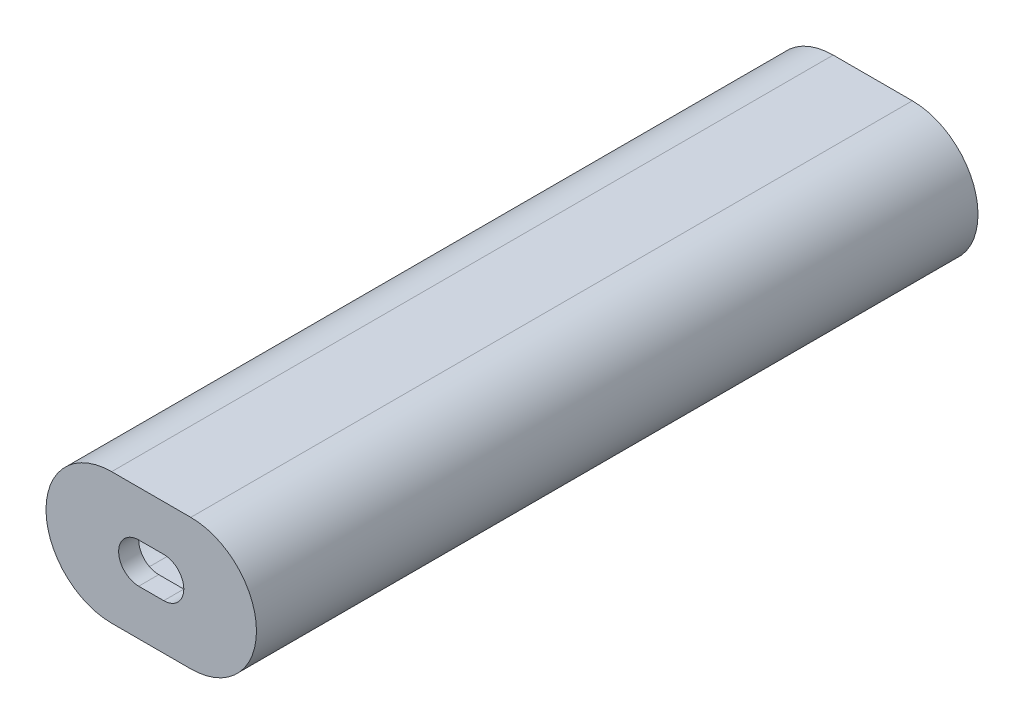
ISO-10303-21;
HEADER;
FILE_DESCRIPTION(('STEP AP214'),'2;1');
FILE_NAME('part.step','',(''),(''),'','','');
FILE_SCHEMA(('AUTOMOTIVE_DESIGN { 1 0 10303 214 1 1 1 1 }'));
ENDSEC;
DATA;
#1=APPLICATION_CONTEXT('core data for automotive mechanical design processes');
#2=APPLICATION_PROTOCOL_DEFINITION('international standard','automotive_design',2000,#1);
#3=PRODUCT_CONTEXT('',#1,'mechanical');
#4=PRODUCT('Part','Part','',(#3));
#5=PRODUCT_RELATED_PRODUCT_CATEGORY('part','',(#4));
#6=PRODUCT_DEFINITION_FORMATION('','',#4);
#7=PRODUCT_DEFINITION_CONTEXT('part definition',#1,'design');
#8=PRODUCT_DEFINITION('design','',#6,#7);
#9=PRODUCT_DEFINITION_SHAPE('','',#8);
#10=(LENGTH_UNIT() NAMED_UNIT(*) SI_UNIT(.MILLI.,.METRE.));
#11=(NAMED_UNIT(*) PLANE_ANGLE_UNIT() SI_UNIT($,.RADIAN.));
#12=(NAMED_UNIT(*) SI_UNIT($,.STERADIAN.) SOLID_ANGLE_UNIT());
#13=UNCERTAINTY_MEASURE_WITH_UNIT(LENGTH_MEASURE(1.E-05),#10,'distance_accuracy_value','');
#14=(GEOMETRIC_REPRESENTATION_CONTEXT(3) GLOBAL_UNCERTAINTY_ASSIGNED_CONTEXT((#13)) GLOBAL_UNIT_ASSIGNED_CONTEXT((#10,
#11,#12)) REPRESENTATION_CONTEXT('',''));
#15=CARTESIAN_POINT('',(0.,0.,0.));
#16=DIRECTION('',(0.,0.,1.));
#17=DIRECTION('',(1.,0.,0.));
#18=AXIS2_PLACEMENT_3D('',#15,#16,#17);
#19=CARTESIAN_POINT('',(12.573,0.,-177.8));
#20=DIRECTION('',(0.,0.,1.));
#21=DIRECTION('',(1.,0.,0.));
#22=AXIS2_PLACEMENT_3D('',#19,#20,#21);
#23=CYLINDRICAL_SURFACE('',#22,11.557);
#24=CARTESIAN_POINT('',(12.573,0.,0.));
#25=DIRECTION('',(0.,0.,1.));
#26=DIRECTION('',(1.,0.,0.));
#27=AXIS2_PLACEMENT_3D('',#24,#25,#26);
#28=CIRCLE('',#27,11.557);
#29=CARTESIAN_POINT('',(12.573,-11.557,0.));
#30=VERTEX_POINT('',#29);
#31=CARTESIAN_POINT('',(12.573,11.557,0.));
#32=VERTEX_POINT('',#31);
#33=EDGE_CURVE('E195',#30,#32,#28,.T.);
#34=ORIENTED_EDGE('',*,*,#33,.T.);
#35=DIRECTION('',(0.,0.,1.));
#36=VECTOR('',#35,1.);
#37=CARTESIAN_POINT('',(12.573,11.557,-177.8));
#38=LINE('',#37,#36);
#39=CARTESIAN_POINT('',(12.573,11.557,-177.8));
#40=VERTEX_POINT('',#39);
#41=EDGE_CURVE('E11',#40,#32,#38,.T.);
#42=ORIENTED_EDGE('',*,*,#41,.F.);
#43=CARTESIAN_POINT('',(12.573,0.,-177.8));
#44=DIRECTION('',(0.,0.,1.));
#45=DIRECTION('',(1.,0.,0.));
#46=AXIS2_PLACEMENT_3D('',#43,#44,#45);
#47=CIRCLE('',#46,11.557);
#48=CARTESIAN_POINT('',(12.573,-11.557,-177.8));
#49=VERTEX_POINT('',#48);
#50=EDGE_CURVE('E208',#49,#40,#47,.T.);
#51=ORIENTED_EDGE('',*,*,#50,.F.);
#52=DIRECTION('',(0.,0.,1.));
#53=VECTOR('',#52,1.);
#54=CARTESIAN_POINT('',(12.573,-11.557,-177.8));
#55=LINE('',#54,#53);
#56=EDGE_CURVE('E232',#49,#30,#55,.T.);
#57=ORIENTED_EDGE('',*,*,#56,.T.);
#58=EDGE_LOOP('',(#34,#42,#51,#57));
#59=FACE_BOUND('',#58,.T.);
#60=ADVANCED_FACE('F37',(#59),#23,.F.);
#61=CARTESIAN_POINT('',(0.,11.557,-177.8));
#62=DIRECTION('',(0.,-1.,0.));
#63=DIRECTION('',(0.,0.,-1.));
#64=AXIS2_PLACEMENT_3D('',#61,#62,#63);
#65=PLANE('',#64);
#66=DIRECTION('',(1.,0.,0.));
#67=VECTOR('',#66,1.);
#68=CARTESIAN_POINT('',(0.,11.557,0.));
#69=LINE('',#68,#67);
#70=CARTESIAN_POINT('',(-12.573,11.557,0.));
#71=VERTEX_POINT('',#70);
#72=EDGE_CURVE('E200',#71,#32,#69,.T.);
#73=ORIENTED_EDGE('',*,*,#72,.F.);
#74=DIRECTION('',(0.,0.,1.));
#75=VECTOR('',#74,1.);
#76=CARTESIAN_POINT('',(-12.573,11.557,-177.8));
#77=LINE('',#76,#75);
#78=CARTESIAN_POINT('',(-12.573,11.557,-177.8));
#79=VERTEX_POINT('',#78);
#80=EDGE_CURVE('E46',#79,#71,#77,.T.);
#81=ORIENTED_EDGE('',*,*,#80,.F.);
#82=DIRECTION('',(1.,0.,0.));
#83=VECTOR('',#82,1.);
#84=CARTESIAN_POINT('',(0.,11.557,-177.8));
#85=LINE('',#84,#83);
#86=EDGE_CURVE('E214',#79,#40,#85,.T.);
#87=ORIENTED_EDGE('',*,*,#86,.T.);
#88=ORIENTED_EDGE('',*,*,#41,.T.);
#89=EDGE_LOOP('',(#73,#81,#87,#88));
#90=FACE_BOUND('',#89,.T.);
#91=ADVANCED_FACE('F279',(#90),#65,.T.);
#92=CARTESIAN_POINT('',(-12.573,0.,-177.8));
#93=DIRECTION('',(0.,0.,1.));
#94=DIRECTION('',(1.,0.,0.));
#95=AXIS2_PLACEMENT_3D('',#92,#93,#94);
#96=CYLINDRICAL_SURFACE('',#95,11.557);
#97=CARTESIAN_POINT('',(-12.573,0.,0.));
#98=DIRECTION('',(0.,0.,1.));
#99=DIRECTION('',(1.,0.,0.));
#100=AXIS2_PLACEMENT_3D('',#97,#98,#99);
#101=CIRCLE('',#100,11.557);
#102=CARTESIAN_POINT('',(-12.573,-11.557,0.));
#103=VERTEX_POINT('',#102);
#104=EDGE_CURVE('E223',#71,#103,#101,.T.);
#105=ORIENTED_EDGE('',*,*,#104,.T.);
#106=DIRECTION('',(0.,0.,1.));
#107=VECTOR('',#106,1.);
#108=CARTESIAN_POINT('',(-12.573,-11.557,-177.8));
#109=LINE('',#108,#107);
#110=CARTESIAN_POINT('',(-12.573,-11.557,-177.8));
#111=VERTEX_POINT('',#110);
#112=EDGE_CURVE('E229',#111,#103,#109,.T.);
#113=ORIENTED_EDGE('',*,*,#112,.F.);
#114=CARTESIAN_POINT('',(-12.573,0.,-177.8));
#115=DIRECTION('',(0.,0.,1.));
#116=DIRECTION('',(1.,0.,0.));
#117=AXIS2_PLACEMENT_3D('',#114,#115,#116);
#118=CIRCLE('',#117,11.557);
#119=EDGE_CURVE('E212',#79,#111,#118,.T.);
#120=ORIENTED_EDGE('',*,*,#119,.F.);
#121=ORIENTED_EDGE('',*,*,#80,.T.);
#122=EDGE_LOOP('',(#105,#113,#120,#121));
#123=FACE_BOUND('',#122,.T.);
#124=ADVANCED_FACE('F276',(#123),#96,.F.);
#125=CARTESIAN_POINT('',(0.,-16.637,-177.8));
#126=DIRECTION('',(0.,-1.,0.));
#127=DIRECTION('',(0.,0.,-1.));
#128=AXIS2_PLACEMENT_3D('',#125,#126,#127);
#129=PLANE('',#128);
#130=CARTESIAN_POINT('',(0.,-16.637,-52.832));
#131=DIRECTION('',(0.,-1.,0.));
#132=DIRECTION('',(0.,0.,-1.));
#133=AXIS2_PLACEMENT_3D('',#130,#131,#132);
#134=CIRCLE('',#133,2.286);
#135=CARTESIAN_POINT('',(0.,-16.637,-55.118));
#136=VERTEX_POINT('',#135);
#137=EDGE_CURVE('E164',#136,#136,#134,.T.);
#138=ORIENTED_EDGE('',*,*,#137,.F.);
#139=EDGE_LOOP('',(#138));
#140=FACE_BOUND('',#139,.T.);
#141=CARTESIAN_POINT('',(0.,-16.637,-119.888));
#142=DIRECTION('',(0.,-1.,0.));
#143=DIRECTION('',(0.,0.,-1.));
#144=AXIS2_PLACEMENT_3D('',#141,#142,#143);
#145=CIRCLE('',#144,2.286);
#146=CARTESIAN_POINT('',(0.,-16.637,-122.174));
#147=VERTEX_POINT('',#146);
#148=EDGE_CURVE('E168',#147,#147,#145,.T.);
#149=ORIENTED_EDGE('',*,*,#148,.F.);
#150=EDGE_LOOP('',(#149));
#151=FACE_BOUND('',#150,.T.);
#152=DIRECTION('',(0.,0.,1.));
#153=VECTOR('',#152,1.);
#154=CARTESIAN_POINT('',(10.033,-16.637,-177.8));
#155=LINE('',#154,#153);
#156=CARTESIAN_POINT('',(10.033,-16.637,-177.8));
#157=VERTEX_POINT('',#156);
#158=CARTESIAN_POINT('',(10.033,-16.637,5.08));
#159=VERTEX_POINT('',#158);
#160=EDGE_CURVE('E217',#157,#159,#155,.T.);
#161=ORIENTED_EDGE('',*,*,#160,.T.);
#162=DIRECTION('',(1.,0.,0.));
#163=VECTOR('',#162,1.);
#164=CARTESIAN_POINT('',(-10.033,-16.637,5.08));
#165=LINE('',#164,#163);
#166=CARTESIAN_POINT('',(-10.033,-16.637,5.08));
#167=VERTEX_POINT('',#166);
#168=EDGE_CURVE('E186',#167,#159,#165,.T.);
#169=ORIENTED_EDGE('',*,*,#168,.F.);
#170=DIRECTION('',(0.,0.,1.));
#171=VECTOR('',#170,1.);
#172=CARTESIAN_POINT('',(-10.033,-16.637,-177.8));
#173=LINE('',#172,#171);
#174=CARTESIAN_POINT('',(-10.033,-16.637,-177.8));
#175=VERTEX_POINT('',#174);
#176=EDGE_CURVE('E235',#175,#167,#173,.T.);
#177=ORIENTED_EDGE('',*,*,#176,.F.);
#178=DIRECTION('',(1.,0.,0.));
#179=VECTOR('',#178,1.);
#180=CARTESIAN_POINT('',(0.,-16.637,-177.8));
#181=LINE('',#180,#179);
#182=EDGE_CURVE('E196',#175,#157,#181,.T.);
#183=ORIENTED_EDGE('',*,*,#182,.T.);
#184=EDGE_LOOP('',(#161,#169,#177,#183));
#185=FACE_BOUND('',#184,.T.);
#186=ADVANCED_FACE('F39',(#140,#151,#185),#129,.T.);
#187=CARTESIAN_POINT('',(-10.033,0.,-177.8));
#188=DIRECTION('',(0.,0.,1.));
#189=DIRECTION('',(1.,0.,0.));
#190=AXIS2_PLACEMENT_3D('',#187,#188,#189);
#191=CYLINDRICAL_SURFACE('',#190,16.637);
#192=ORIENTED_EDGE('',*,*,#176,.T.);
#193=CARTESIAN_POINT('',(-10.033,0.,5.08));
#194=DIRECTION('',(0.,0.,1.));
#195=DIRECTION('',(1.,0.,0.));
#196=AXIS2_PLACEMENT_3D('',#193,#194,#195);
#197=CIRCLE('',#196,16.637);
#198=CARTESIAN_POINT('',(-10.033,16.637,5.08));
#199=VERTEX_POINT('',#198);
#200=EDGE_CURVE('E181',#199,#167,#197,.T.);
#201=ORIENTED_EDGE('',*,*,#200,.F.);
#202=DIRECTION('',(0.,0.,1.));
#203=VECTOR('',#202,1.);
#204=CARTESIAN_POINT('',(-10.033,16.637,-177.8));
#205=LINE('',#204,#203);
#206=CARTESIAN_POINT('',(-10.033,16.637,-177.8));
#207=VERTEX_POINT('',#206);
#208=EDGE_CURVE('E237',#207,#199,#205,.T.);
#209=ORIENTED_EDGE('',*,*,#208,.F.);
#210=CARTESIAN_POINT('',(-10.033,0.,-177.8));
#211=DIRECTION('',(0.,0.,1.));
#212=DIRECTION('',(1.,0.,0.));
#213=AXIS2_PLACEMENT_3D('',#210,#211,#212);
#214=CIRCLE('',#213,16.637);
#215=EDGE_CURVE('E205',#207,#175,#214,.T.);
#216=ORIENTED_EDGE('',*,*,#215,.T.);
#217=EDGE_LOOP('',(#192,#201,#209,#216));
#218=FACE_BOUND('',#217,.T.);
#219=ADVANCED_FACE('F291',(#218),#191,.T.);
#220=CARTESIAN_POINT('',(0.,16.637,-177.8));
#221=DIRECTION('',(0.,-1.,0.));
#222=DIRECTION('',(0.,0.,-1.));
#223=AXIS2_PLACEMENT_3D('',#220,#221,#222);
#224=PLANE('',#223);
#225=ORIENTED_EDGE('',*,*,#208,.T.);
#226=DIRECTION('',(-1.,0.,0.));
#227=VECTOR('',#226,1.);
#228=CARTESIAN_POINT('',(-10.033,16.637,5.08));
#229=LINE('',#228,#227);
#230=CARTESIAN_POINT('',(10.033,16.637,5.08));
#231=VERTEX_POINT('',#230);
#232=EDGE_CURVE('E192',#231,#199,#229,.T.);
#233=ORIENTED_EDGE('',*,*,#232,.F.);
#234=DIRECTION('',(0.,0.,1.));
#235=VECTOR('',#234,1.);
#236=CARTESIAN_POINT('',(10.033,16.637,-177.8));
#237=LINE('',#236,#235);
#238=CARTESIAN_POINT('',(10.033,16.637,-177.8));
#239=VERTEX_POINT('',#238);
#240=EDGE_CURVE('E239',#239,#231,#237,.T.);
#241=ORIENTED_EDGE('',*,*,#240,.F.);
#242=DIRECTION('',(1.,0.,0.));
#243=VECTOR('',#242,1.);
#244=CARTESIAN_POINT('',(0.,16.637,-177.8));
#245=LINE('',#244,#243);
#246=EDGE_CURVE('E203',#207,#239,#245,.T.);
#247=ORIENTED_EDGE('',*,*,#246,.F.);
#248=EDGE_LOOP('',(#225,#233,#241,#247));
#249=FACE_BOUND('',#248,.T.);
#250=ADVANCED_FACE('F294',(#249),#224,.F.);
#251=CARTESIAN_POINT('',(10.033,0.,-177.8));
#252=DIRECTION('',(0.,0.,1.));
#253=DIRECTION('',(1.,0.,0.));
#254=AXIS2_PLACEMENT_3D('',#251,#252,#253);
#255=CYLINDRICAL_SURFACE('',#254,16.637);
#256=ORIENTED_EDGE('',*,*,#240,.T.);
#257=CARTESIAN_POINT('',(10.033,0.,5.08));
#258=DIRECTION('',(0.,0.,1.));
#259=DIRECTION('',(1.,0.,0.));
#260=AXIS2_PLACEMENT_3D('',#257,#258,#259);
#261=CIRCLE('',#260,16.637);
#262=EDGE_CURVE('E189',#159,#231,#261,.T.);
#263=ORIENTED_EDGE('',*,*,#262,.F.);
#264=ORIENTED_EDGE('',*,*,#160,.F.);
#265=CARTESIAN_POINT('',(10.033,0.,-177.8));
#266=DIRECTION('',(0.,0.,1.));
#267=DIRECTION('',(1.,0.,0.));
#268=AXIS2_PLACEMENT_3D('',#265,#266,#267);
#269=CIRCLE('',#268,16.637);
#270=EDGE_CURVE('E199',#157,#239,#269,.T.);
#271=ORIENTED_EDGE('',*,*,#270,.T.);
#272=EDGE_LOOP('',(#256,#263,#264,#271));
#273=FACE_BOUND('',#272,.T.);
#274=ADVANCED_FACE('F263',(#273),#255,.T.);
#275=CARTESIAN_POINT('',(0.,-11.557,-177.8));
#276=DIRECTION('',(0.,-1.,0.));
#277=DIRECTION('',(0.,0.,-1.));
#278=AXIS2_PLACEMENT_3D('',#275,#276,#277);
#279=PLANE('',#278);
#280=CARTESIAN_POINT('',(0.,-11.557,-52.832));
#281=DIRECTION('',(0.,1.,0.));
#282=DIRECTION('',(0.,0.,1.));
#283=AXIS2_PLACEMENT_3D('',#280,#281,#282);
#284=CIRCLE('',#283,3.683);
#285=CARTESIAN_POINT('',(0.,-11.557,-49.149));
#286=VERTEX_POINT('',#285);
#287=EDGE_CURVE('E171',#286,#286,#284,.T.);
#288=ORIENTED_EDGE('',*,*,#287,.F.);
#289=EDGE_LOOP('',(#288));
#290=FACE_BOUND('',#289,.T.);
#291=CARTESIAN_POINT('',(0.,-11.557,-119.888));
#292=DIRECTION('',(0.,1.,0.));
#293=DIRECTION('',(0.,0.,1.));
#294=AXIS2_PLACEMENT_3D('',#291,#292,#293);
#295=CIRCLE('',#294,3.683);
#296=CARTESIAN_POINT('',(0.,-11.557,-116.205));
#297=VERTEX_POINT('',#296);
#298=EDGE_CURVE('E175',#297,#297,#295,.T.);
#299=ORIENTED_EDGE('',*,*,#298,.F.);
#300=EDGE_LOOP('',(#299));
#301=FACE_BOUND('',#300,.T.);
#302=DIRECTION('',(1.,0.,0.));
#303=VECTOR('',#302,1.);
#304=CARTESIAN_POINT('',(0.,-11.557,0.));
#305=LINE('',#304,#303);
#306=EDGE_CURVE('E220',#103,#30,#305,.T.);
#307=ORIENTED_EDGE('',*,*,#306,.T.);
#308=ORIENTED_EDGE('',*,*,#56,.F.);
#309=DIRECTION('',(1.,0.,0.));
#310=VECTOR('',#309,1.);
#311=CARTESIAN_POINT('',(0.,-11.557,-177.8));
#312=LINE('',#311,#310);
#313=EDGE_CURVE('E210',#111,#49,#312,.T.);
#314=ORIENTED_EDGE('',*,*,#313,.F.);
#315=ORIENTED_EDGE('',*,*,#112,.T.);
#316=EDGE_LOOP('',(#307,#308,#314,#315));
#317=FACE_BOUND('',#316,.T.);
#318=ADVANCED_FACE('F259',(#290,#301,#317),#279,.F.);
#319=CARTESIAN_POINT('',(0.,0.,-177.8));
#320=DIRECTION('',(0.,0.,1.));
#321=DIRECTION('',(1.,0.,0.));
#322=AXIS2_PLACEMENT_3D('',#319,#320,#321);
#323=PLANE('',#322);
#324=ORIENTED_EDGE('',*,*,#182,.F.);
#325=ORIENTED_EDGE('',*,*,#215,.F.);
#326=ORIENTED_EDGE('',*,*,#246,.T.);
#327=ORIENTED_EDGE('',*,*,#270,.F.);
#328=EDGE_LOOP('',(#324,#325,#326,#327));
#329=FACE_BOUND('',#328,.T.);
#330=ORIENTED_EDGE('',*,*,#50,.T.);
#331=ORIENTED_EDGE('',*,*,#86,.F.);
#332=ORIENTED_EDGE('',*,*,#119,.T.);
#333=ORIENTED_EDGE('',*,*,#313,.T.);
#334=EDGE_LOOP('',(#330,#331,#332,#333));
#335=FACE_BOUND('',#334,.T.);
#336=ADVANCED_FACE('F262',(#329,#335),#323,.F.);
#337=CARTESIAN_POINT('',(-10.033,0.,5.08));
#338=DIRECTION('',(0.,0.,1.));
#339=DIRECTION('',(1.,0.,0.));
#340=AXIS2_PLACEMENT_3D('',#337,#338,#339);
#341=PLANE('',#340);
#342=CARTESIAN_POINT('',(-3.175,0.,5.08));
#343=DIRECTION('',(0.,0.,1.));
#344=DIRECTION('',(1.,0.,0.));
#345=AXIS2_PLACEMENT_3D('',#342,#343,#344);
#346=CIRCLE('',#345,5.08);
#347=CARTESIAN_POINT('',(-3.175,5.08,5.08));
#348=VERTEX_POINT('',#347);
#349=CARTESIAN_POINT('',(-3.175,-5.08,5.08));
#350=VERTEX_POINT('',#349);
#351=EDGE_CURVE('E54',#348,#350,#346,.T.);
#352=ORIENTED_EDGE('',*,*,#351,.F.);
#353=DIRECTION('',(-1.,0.,0.));
#354=VECTOR('',#353,1.);
#355=CARTESIAN_POINT('',(-3.175,5.08,5.08));
#356=LINE('',#355,#354);
#357=CARTESIAN_POINT('',(3.175,5.08,5.08));
#358=VERTEX_POINT('',#357);
#359=EDGE_CURVE('E146',#358,#348,#356,.T.);
#360=ORIENTED_EDGE('',*,*,#359,.F.);
#361=CARTESIAN_POINT('',(3.175,0.,5.08));
#362=DIRECTION('',(0.,0.,1.));
#363=DIRECTION('',(1.,0.,0.));
#364=AXIS2_PLACEMENT_3D('',#361,#362,#363);
#365=CIRCLE('',#364,5.08);
#366=CARTESIAN_POINT('',(3.175,-5.08,5.08));
#367=VERTEX_POINT('',#366);
#368=EDGE_CURVE('E149',#367,#358,#365,.T.);
#369=ORIENTED_EDGE('',*,*,#368,.F.);
#370=DIRECTION('',(1.,0.,0.));
#371=VECTOR('',#370,1.);
#372=CARTESIAN_POINT('',(-3.175,-5.08,5.08));
#373=LINE('',#372,#371);
#374=EDGE_CURVE('E155',#350,#367,#373,.T.);
#375=ORIENTED_EDGE('',*,*,#374,.F.);
#376=EDGE_LOOP('',(#352,#360,#369,#375));
#377=FACE_BOUND('',#376,.T.);
#378=ORIENTED_EDGE('',*,*,#200,.T.);
#379=ORIENTED_EDGE('',*,*,#168,.T.);
#380=ORIENTED_EDGE('',*,*,#262,.T.);
#381=ORIENTED_EDGE('',*,*,#232,.T.);
#382=EDGE_LOOP('',(#378,#379,#380,#381));
#383=FACE_BOUND('',#382,.T.);
#384=ADVANCED_FACE('F308',(#377,#383),#341,.T.);
#385=CARTESIAN_POINT('',(-10.033,0.,0.));
#386=DIRECTION('',(0.,0.,1.));
#387=DIRECTION('',(1.,0.,0.));
#388=AXIS2_PLACEMENT_3D('',#385,#386,#387);
#389=PLANE('',#388);
#390=DIRECTION('',(-1.,0.,0.));
#391=VECTOR('',#390,1.);
#392=CARTESIAN_POINT('',(-3.175,5.08,0.));
#393=LINE('',#392,#391);
#394=CARTESIAN_POINT('',(3.175,5.08,0.));
#395=VERTEX_POINT('',#394);
#396=CARTESIAN_POINT('',(-3.175,5.08,0.));
#397=VERTEX_POINT('',#396);
#398=EDGE_CURVE('E136',#395,#397,#393,.T.);
#399=ORIENTED_EDGE('',*,*,#398,.T.);
#400=CARTESIAN_POINT('',(-3.175,0.,0.));
#401=DIRECTION('',(0.,0.,1.));
#402=DIRECTION('',(1.,0.,0.));
#403=AXIS2_PLACEMENT_3D('',#400,#401,#402);
#404=CIRCLE('',#403,5.08);
#405=CARTESIAN_POINT('',(-3.175,-5.08,0.));
#406=VERTEX_POINT('',#405);
#407=EDGE_CURVE('E130',#397,#406,#404,.T.);
#408=ORIENTED_EDGE('',*,*,#407,.T.);
#409=DIRECTION('',(1.,0.,0.));
#410=VECTOR('',#409,1.);
#411=CARTESIAN_POINT('',(-3.175,-5.08,0.));
#412=LINE('',#411,#410);
#413=CARTESIAN_POINT('',(3.175,-5.08,0.));
#414=VERTEX_POINT('',#413);
#415=EDGE_CURVE('E139',#406,#414,#412,.T.);
#416=ORIENTED_EDGE('',*,*,#415,.T.);
#417=CARTESIAN_POINT('',(3.175,0.,0.));
#418=DIRECTION('',(0.,0.,1.));
#419=DIRECTION('',(1.,0.,0.));
#420=AXIS2_PLACEMENT_3D('',#417,#418,#419);
#421=CIRCLE('',#420,5.08);
#422=EDGE_CURVE('E62',#414,#395,#421,.T.);
#423=ORIENTED_EDGE('',*,*,#422,.T.);
#424=EDGE_LOOP('',(#399,#408,#416,#423));
#425=FACE_BOUND('',#424,.T.);
#426=ORIENTED_EDGE('',*,*,#72,.T.);
#427=ORIENTED_EDGE('',*,*,#33,.F.);
#428=ORIENTED_EDGE('',*,*,#306,.F.);
#429=ORIENTED_EDGE('',*,*,#104,.F.);
#430=EDGE_LOOP('',(#426,#427,#428,#429));
#431=FACE_BOUND('',#430,.T.);
#432=ADVANCED_FACE('F143',(#425,#431),#389,.F.);
#433=CARTESIAN_POINT('',(0.,-15.748,-119.888));
#434=DIRECTION('',(0.,1.,0.));
#435=DIRECTION('',(0.,0.,1.));
#436=AXIS2_PLACEMENT_3D('',#433,#434,#435);
#437=CYLINDRICAL_SURFACE('',#436,3.683);
#438=CARTESIAN_POINT('',(0.,-15.748,-119.888));
#439=DIRECTION('',(0.,1.,0.));
#440=DIRECTION('',(0.,0.,1.));
#441=AXIS2_PLACEMENT_3D('',#438,#439,#440);
#442=CIRCLE('',#441,3.683);
#443=CARTESIAN_POINT('',(0.,-15.748,-116.205));
#444=VERTEX_POINT('',#443);
#445=EDGE_CURVE('E178',#444,#444,#442,.T.);
#446=ORIENTED_EDGE('',*,*,#445,.F.);
#447=EDGE_LOOP('',(#446));
#448=FACE_BOUND('',#447,.T.);
#449=ORIENTED_EDGE('',*,*,#298,.T.);
#450=EDGE_LOOP('',(#449));
#451=FACE_BOUND('',#450,.T.);
#452=ADVANCED_FACE('F250',(#448,#451),#437,.F.);
#453=CARTESIAN_POINT('',(0.,-15.748,-119.888));
#454=DIRECTION('',(0.,1.,0.));
#455=DIRECTION('',(0.,0.,1.));
#456=AXIS2_PLACEMENT_3D('',#453,#454,#455);
#457=PLANE('',#456);
#458=CARTESIAN_POINT('',(0.,-15.748,-119.888));
#459=DIRECTION('',(0.,1.,0.));
#460=DIRECTION('',(0.,0.,1.));
#461=AXIS2_PLACEMENT_3D('',#458,#459,#460);
#462=CIRCLE('',#461,2.286);
#463=CARTESIAN_POINT('',(0.,-15.748,-117.602));
#464=VERTEX_POINT('',#463);
#465=EDGE_CURVE('E167',#464,#464,#462,.T.);
#466=ORIENTED_EDGE('',*,*,#465,.F.);
#467=EDGE_LOOP('',(#466));
#468=FACE_BOUND('',#467,.T.);
#469=ORIENTED_EDGE('',*,*,#445,.T.);
#470=EDGE_LOOP('',(#469));
#471=FACE_BOUND('',#470,.T.);
#472=ADVANCED_FACE('F246',(#468,#471),#457,.T.);
#473=CARTESIAN_POINT('',(0.,-15.748,-52.832));
#474=DIRECTION('',(0.,1.,0.));
#475=DIRECTION('',(0.,0.,1.));
#476=AXIS2_PLACEMENT_3D('',#473,#474,#475);
#477=CYLINDRICAL_SURFACE('',#476,3.683);
#478=CARTESIAN_POINT('',(0.,-15.748,-52.832));
#479=DIRECTION('',(0.,1.,0.));
#480=DIRECTION('',(0.,0.,1.));
#481=AXIS2_PLACEMENT_3D('',#478,#479,#480);
#482=CIRCLE('',#481,3.683);
#483=CARTESIAN_POINT('',(0.,-15.748,-49.149));
#484=VERTEX_POINT('',#483);
#485=EDGE_CURVE('E172',#484,#484,#482,.T.);
#486=ORIENTED_EDGE('',*,*,#485,.F.);
#487=EDGE_LOOP('',(#486));
#488=FACE_BOUND('',#487,.T.);
#489=ORIENTED_EDGE('',*,*,#287,.T.);
#490=EDGE_LOOP('',(#489));
#491=FACE_BOUND('',#490,.T.);
#492=ADVANCED_FACE('F249',(#488,#491),#477,.F.);
#493=CARTESIAN_POINT('',(0.,-15.748,-52.832));
#494=DIRECTION('',(0.,1.,0.));
#495=DIRECTION('',(0.,0.,1.));
#496=AXIS2_PLACEMENT_3D('',#493,#494,#495);
#497=PLANE('',#496);
#498=CARTESIAN_POINT('',(0.,-15.748,-52.832));
#499=DIRECTION('',(0.,1.,0.));
#500=DIRECTION('',(0.,0.,1.));
#501=AXIS2_PLACEMENT_3D('',#498,#499,#500);
#502=CIRCLE('',#501,2.286);
#503=CARTESIAN_POINT('',(0.,-15.748,-50.546));
#504=VERTEX_POINT('',#503);
#505=EDGE_CURVE('E41',#504,#504,#502,.T.);
#506=ORIENTED_EDGE('',*,*,#505,.F.);
#507=EDGE_LOOP('',(#506));
#508=FACE_BOUND('',#507,.T.);
#509=ORIENTED_EDGE('',*,*,#485,.T.);
#510=EDGE_LOOP('',(#509));
#511=FACE_BOUND('',#510,.T.);
#512=ADVANCED_FACE('F327',(#508,#511),#497,.T.);
#513=CARTESIAN_POINT('',(0.,-18.288,-119.888));
#514=DIRECTION('',(0.,1.,0.));
#515=DIRECTION('',(0.,0.,1.));
#516=AXIS2_PLACEMENT_3D('',#513,#514,#515);
#517=CYLINDRICAL_SURFACE('',#516,2.286);
#518=ORIENTED_EDGE('',*,*,#148,.T.);
#519=EDGE_LOOP('',(#518));
#520=FACE_BOUND('',#519,.T.);
#521=ORIENTED_EDGE('',*,*,#465,.T.);
#522=EDGE_LOOP('',(#521));
#523=FACE_BOUND('',#522,.T.);
#524=ADVANCED_FACE('F244',(#520,#523),#517,.F.);
#525=CARTESIAN_POINT('',(0.,-18.288,-52.832));
#526=DIRECTION('',(0.,1.,0.));
#527=DIRECTION('',(0.,0.,1.));
#528=AXIS2_PLACEMENT_3D('',#525,#526,#527);
#529=CYLINDRICAL_SURFACE('',#528,2.286);
#530=ORIENTED_EDGE('',*,*,#137,.T.);
#531=EDGE_LOOP('',(#530));
#532=FACE_BOUND('',#531,.T.);
#533=ORIENTED_EDGE('',*,*,#505,.T.);
#534=EDGE_LOOP('',(#533));
#535=FACE_BOUND('',#534,.T.);
#536=ADVANCED_FACE('F334',(#532,#535),#529,.F.);
#537=CARTESIAN_POINT('',(-3.175,0.,0.));
#538=DIRECTION('',(0.,0.,1.));
#539=DIRECTION('',(1.,0.,0.));
#540=AXIS2_PLACEMENT_3D('',#537,#538,#539);
#541=CYLINDRICAL_SURFACE('',#540,5.08);
#542=ORIENTED_EDGE('',*,*,#351,.T.);
#543=DIRECTION('',(0.,0.,1.));
#544=VECTOR('',#543,1.);
#545=CARTESIAN_POINT('',(-3.175,-5.08,0.));
#546=LINE('',#545,#544);
#547=EDGE_CURVE('E126',#406,#350,#546,.T.);
#548=ORIENTED_EDGE('',*,*,#547,.F.);
#549=ORIENTED_EDGE('',*,*,#407,.F.);
#550=DIRECTION('',(0.,0.,1.));
#551=VECTOR('',#550,1.);
#552=CARTESIAN_POINT('',(-3.175,5.08,0.));
#553=LINE('',#552,#551);
#554=EDGE_CURVE('E159',#397,#348,#553,.T.);
#555=ORIENTED_EDGE('',*,*,#554,.T.);
#556=EDGE_LOOP('',(#542,#548,#549,#555));
#557=FACE_BOUND('',#556,.T.);
#558=ADVANCED_FACE('F128',(#557),#541,.F.);
#559=CARTESIAN_POINT('',(-3.175,5.08,0.));
#560=DIRECTION('',(0.,1.,0.));
#561=DIRECTION('',(0.,0.,1.));
#562=AXIS2_PLACEMENT_3D('',#559,#560,#561);
#563=PLANE('',#562);
#564=ORIENTED_EDGE('',*,*,#359,.T.);
#565=ORIENTED_EDGE('',*,*,#554,.F.);
#566=ORIENTED_EDGE('',*,*,#398,.F.);
#567=DIRECTION('',(0.,0.,1.));
#568=VECTOR('',#567,1.);
#569=CARTESIAN_POINT('',(3.175,5.08,0.));
#570=LINE('',#569,#568);
#571=EDGE_CURVE('E161',#395,#358,#570,.T.);
#572=ORIENTED_EDGE('',*,*,#571,.T.);
#573=EDGE_LOOP('',(#564,#565,#566,#572));
#574=FACE_BOUND('',#573,.T.);
#575=ADVANCED_FACE('F341',(#574),#563,.F.);
#576=CARTESIAN_POINT('',(3.175,0.,0.));
#577=DIRECTION('',(0.,0.,1.));
#578=DIRECTION('',(1.,0.,0.));
#579=AXIS2_PLACEMENT_3D('',#576,#577,#578);
#580=CYLINDRICAL_SURFACE('',#579,5.08);
#581=ORIENTED_EDGE('',*,*,#368,.T.);
#582=ORIENTED_EDGE('',*,*,#571,.F.);
#583=ORIENTED_EDGE('',*,*,#422,.F.);
#584=DIRECTION('',(0.,0.,1.));
#585=VECTOR('',#584,1.);
#586=CARTESIAN_POINT('',(3.175,-5.08,0.));
#587=LINE('',#586,#585);
#588=EDGE_CURVE('E135',#414,#367,#587,.T.);
#589=ORIENTED_EDGE('',*,*,#588,.T.);
#590=EDGE_LOOP('',(#581,#582,#583,#589));
#591=FACE_BOUND('',#590,.T.);
#592=ADVANCED_FACE('F344',(#591),#580,.F.);
#593=CARTESIAN_POINT('',(-3.175,-5.08,0.));
#594=DIRECTION('',(0.,-1.,0.));
#595=DIRECTION('',(0.,0.,-1.));
#596=AXIS2_PLACEMENT_3D('',#593,#594,#595);
#597=PLANE('',#596);
#598=ORIENTED_EDGE('',*,*,#374,.T.);
#599=ORIENTED_EDGE('',*,*,#588,.F.);
#600=ORIENTED_EDGE('',*,*,#415,.F.);
#601=ORIENTED_EDGE('',*,*,#547,.T.);
#602=EDGE_LOOP('',(#598,#599,#600,#601));
#603=FACE_BOUND('',#602,.T.);
#604=ADVANCED_FACE('F140',(#603),#597,.F.);
#605=CLOSED_SHELL('',(#60,#91,#124,#186,#219,#250,#274,#318,#336,#384,#432,#452,#472,#492,#512,
#524,#536,#558,#575,#592,#604));
#606=MANIFOLD_SOLID_BREP('B2',#605);
#607=ADVANCED_BREP_SHAPE_REPRESENTATION('',(#18,#606),#14);
#608=SHAPE_DEFINITION_REPRESENTATION(#9,#607);
ENDSEC;
END-ISO-10303-21;
